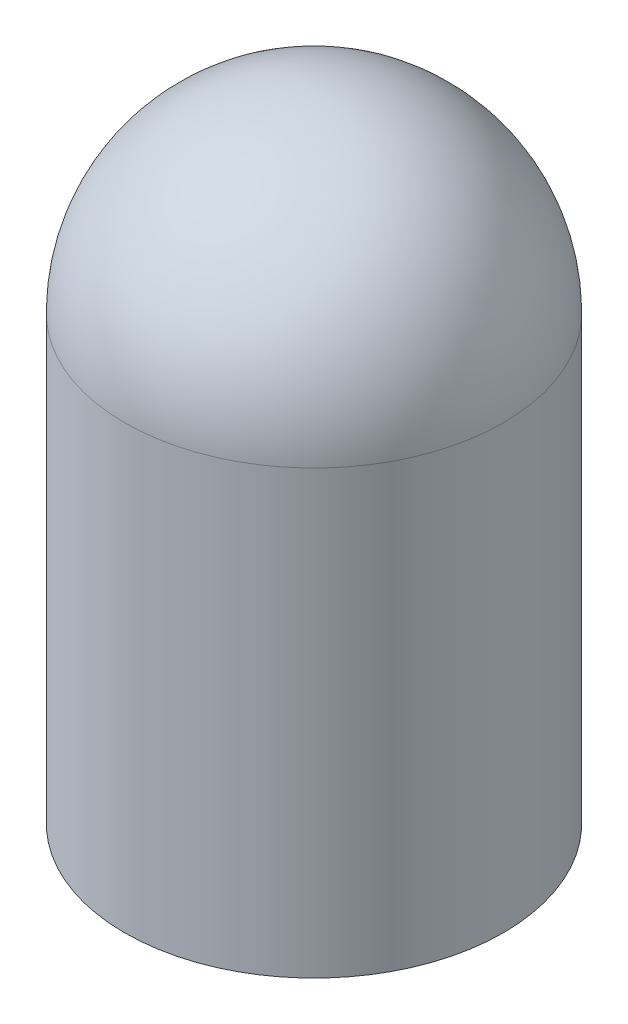
ISO-10303-21;
HEADER;
FILE_DESCRIPTION(('STEP AP214'),'2;1');
FILE_NAME('part.step','',(''),(''),'','','');
FILE_SCHEMA(('AUTOMOTIVE_DESIGN { 1 0 10303 214 1 1 1 1 }'));
ENDSEC;
DATA;
#1=APPLICATION_CONTEXT('core data for automotive mechanical design processes');
#2=APPLICATION_PROTOCOL_DEFINITION('international standard','automotive_design',2000,#1);
#3=PRODUCT_CONTEXT('',#1,'mechanical');
#4=PRODUCT('Part','Part','',(#3));
#5=PRODUCT_RELATED_PRODUCT_CATEGORY('part','',(#4));
#6=PRODUCT_DEFINITION_FORMATION('','',#4);
#7=PRODUCT_DEFINITION_CONTEXT('part definition',#1,'design');
#8=PRODUCT_DEFINITION('design','',#6,#7);
#9=PRODUCT_DEFINITION_SHAPE('','',#8);
#10=(LENGTH_UNIT() NAMED_UNIT(*) SI_UNIT(.MILLI.,.METRE.));
#11=(NAMED_UNIT(*) PLANE_ANGLE_UNIT() SI_UNIT($,.RADIAN.));
#12=(NAMED_UNIT(*) SI_UNIT($,.STERADIAN.) SOLID_ANGLE_UNIT());
#13=UNCERTAINTY_MEASURE_WITH_UNIT(LENGTH_MEASURE(1.E-05),#10,'distance_accuracy_value','');
#14=(GEOMETRIC_REPRESENTATION_CONTEXT(3) GLOBAL_UNCERTAINTY_ASSIGNED_CONTEXT((#13)) GLOBAL_UNIT_ASSIGNED_CONTEXT((#10,
#11,#12)) REPRESENTATION_CONTEXT('',''));
#15=CARTESIAN_POINT('',(0.,0.,0.));
#16=DIRECTION('',(0.,0.,1.));
#17=DIRECTION('',(1.,0.,0.));
#18=AXIS2_PLACEMENT_3D('',#15,#16,#17);
#19=CARTESIAN_POINT('',(0.,0.,0.));
#20=DIRECTION('',(0.,1.,0.));
#21=DIRECTION('',(0.,0.,1.));
#22=AXIS2_PLACEMENT_3D('',#19,#20,#21);
#23=PLANE('',#22);
#24=CARTESIAN_POINT('',(0.,0.,0.));
#25=DIRECTION('',(0.,1.,0.));
#26=DIRECTION('',(0.,0.,1.));
#27=AXIS2_PLACEMENT_3D('',#24,#25,#26);
#28=CIRCLE('',#27,30.);
#29=CARTESIAN_POINT('',(0.,0.,30.));
#30=VERTEX_POINT('',#29);
#31=EDGE_CURVE('E39',#30,#30,#28,.T.);
#32=ORIENTED_EDGE('',*,*,#31,.F.);
#33=EDGE_LOOP('',(#32));
#34=FACE_BOUND('',#33,.T.);
#35=ADVANCED_FACE('F33',(#34),#23,.F.);
#36=CARTESIAN_POINT('',(0.,70.,0.));
#37=DIRECTION('',(0.,1.,0.));
#38=DIRECTION('',(1.,0.,0.));
#39=AXIS2_PLACEMENT_3D('',#36,#37,#38);
#40=SPHERICAL_SURFACE('',#39,30.);
#41=CARTESIAN_POINT('',(0.,70.,0.));
#42=DIRECTION('',(0.,1.,0.));
#43=DIRECTION('',(0.,0.,1.));
#44=AXIS2_PLACEMENT_3D('',#41,#42,#43);
#45=CIRCLE('',#44,30.);
#46=CARTESIAN_POINT('',(0.,70.,30.));
#47=VERTEX_POINT('',#46);
#48=EDGE_CURVE('E10',#47,#47,#45,.T.);
#49=ORIENTED_EDGE('',*,*,#48,.T.);
#50=EDGE_LOOP('',(#49));
#51=FACE_BOUND('',#50,.T.);
#52=ADVANCED_FACE('F48',(#51),#40,.T.);
#53=CARTESIAN_POINT('',(0.,100.,0.));
#54=DIRECTION('',(0.,1.,0.));
#55=DIRECTION('',(0.,0.,1.));
#56=AXIS2_PLACEMENT_3D('',#53,#54,#55);
#57=CYLINDRICAL_SURFACE('',#56,30.);
#58=ORIENTED_EDGE('',*,*,#48,.F.);
#59=EDGE_LOOP('',(#58));
#60=FACE_BOUND('',#59,.T.);
#61=ORIENTED_EDGE('',*,*,#31,.T.);
#62=EDGE_LOOP('',(#61));
#63=FACE_BOUND('',#62,.T.);
#64=ADVANCED_FACE('F45',(#60,#63),#57,.T.);
#65=CLOSED_SHELL('',(#35,#52,#64));
#66=MANIFOLD_SOLID_BREP('B2',#65);
#67=ADVANCED_BREP_SHAPE_REPRESENTATION('',(#18,#66),#14);
#68=SHAPE_DEFINITION_REPRESENTATION(#9,#67);
ENDSEC;
END-ISO-10303-21;
